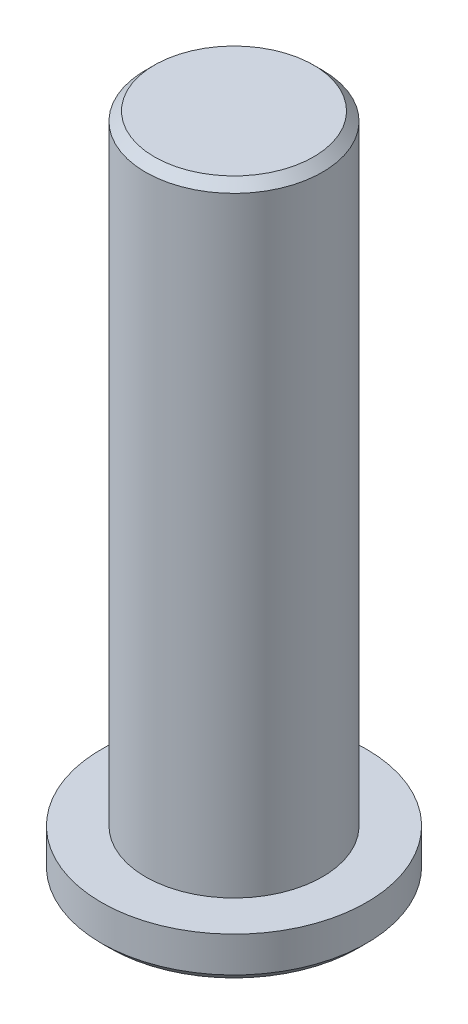
ISO-10303-21;
HEADER;
FILE_DESCRIPTION(('STEP AP214'),'2;1');
FILE_NAME('part.step','',(''),(''),'','','');
FILE_SCHEMA(('AUTOMOTIVE_DESIGN { 1 0 10303 214 1 1 1 1 }'));
ENDSEC;
DATA;
#1=APPLICATION_CONTEXT('core data for automotive mechanical design processes');
#2=APPLICATION_PROTOCOL_DEFINITION('international standard','automotive_design',2000,#1);
#3=PRODUCT_CONTEXT('',#1,'mechanical');
#4=PRODUCT('Part','Part','',(#3));
#5=PRODUCT_RELATED_PRODUCT_CATEGORY('part','',(#4));
#6=PRODUCT_DEFINITION_FORMATION('','',#4);
#7=PRODUCT_DEFINITION_CONTEXT('part definition',#1,'design');
#8=PRODUCT_DEFINITION('design','',#6,#7);
#9=PRODUCT_DEFINITION_SHAPE('','',#8);
#10=(LENGTH_UNIT() NAMED_UNIT(*) SI_UNIT(.MILLI.,.METRE.));
#11=(NAMED_UNIT(*) PLANE_ANGLE_UNIT() SI_UNIT($,.RADIAN.));
#12=(NAMED_UNIT(*) SI_UNIT($,.STERADIAN.) SOLID_ANGLE_UNIT());
#13=UNCERTAINTY_MEASURE_WITH_UNIT(LENGTH_MEASURE(1.E-05),#10,'distance_accuracy_value','');
#14=(GEOMETRIC_REPRESENTATION_CONTEXT(3) GLOBAL_UNCERTAINTY_ASSIGNED_CONTEXT((#13)) GLOBAL_UNIT_ASSIGNED_CONTEXT((#10,
#11,#12)) REPRESENTATION_CONTEXT('',''));
#15=CARTESIAN_POINT('',(0.,0.,0.));
#16=DIRECTION('',(0.,0.,1.));
#17=DIRECTION('',(1.,0.,0.));
#18=AXIS2_PLACEMENT_3D('',#15,#16,#17);
#19=CARTESIAN_POINT('',(0.,5.,0.));
#20=DIRECTION('',(0.,-1.,0.));
#21=DIRECTION('',(0.,0.,-1.));
#22=AXIS2_PLACEMENT_3D('',#19,#20,#21);
#23=CYLINDRICAL_SURFACE('',#22,15.);
#24=CARTESIAN_POINT('',(0.,1.00000000000002,0.));
#25=DIRECTION('',(0.,1.,0.));
#26=DIRECTION('',(0.,0.,1.));
#27=AXIS2_PLACEMENT_3D('',#24,#25,#26);
#28=CIRCLE('',#27,15.);
#29=CARTESIAN_POINT('',(0.,1.00000000000002,15.));
#30=VERTEX_POINT('',#29);
#31=EDGE_CURVE('E39',#30,#30,#28,.T.);
#32=ORIENTED_EDGE('',*,*,#31,.T.);
#33=EDGE_LOOP('',(#32));
#34=FACE_BOUND('',#33,.T.);
#35=CARTESIAN_POINT('',(0.,5.,0.));
#36=DIRECTION('',(0.,1.,0.));
#37=DIRECTION('',(0.,0.,1.));
#38=AXIS2_PLACEMENT_3D('',#35,#36,#37);
#39=CIRCLE('',#38,15.);
#40=CARTESIAN_POINT('',(0.,5.,15.));
#41=VERTEX_POINT('',#40);
#42=EDGE_CURVE('E53',#41,#41,#39,.T.);
#43=ORIENTED_EDGE('',*,*,#42,.F.);
#44=EDGE_LOOP('',(#43));
#45=FACE_BOUND('',#44,.T.);
#46=ADVANCED_FACE('F32',(#34,#45),#23,.T.);
#47=CARTESIAN_POINT('',(0.,5.,0.));
#48=DIRECTION('',(0.,1.,0.));
#49=DIRECTION('',(0.,0.,1.));
#50=AXIS2_PLACEMENT_3D('',#47,#48,#49);
#51=PLANE('',#50);
#52=CARTESIAN_POINT('',(0.,5.,0.));
#53=DIRECTION('',(0.,1.,0.));
#54=DIRECTION('',(0.,0.,1.));
#55=AXIS2_PLACEMENT_3D('',#52,#53,#54);
#56=CIRCLE('',#55,10.);
#57=CARTESIAN_POINT('',(0.,5.,10.));
#58=VERTEX_POINT('',#57);
#59=EDGE_CURVE('E52',#58,#58,#56,.T.);
#60=ORIENTED_EDGE('',*,*,#59,.F.);
#61=EDGE_LOOP('',(#60));
#62=FACE_BOUND('',#61,.T.);
#63=ORIENTED_EDGE('',*,*,#42,.T.);
#64=EDGE_LOOP('',(#63));
#65=FACE_BOUND('',#64,.T.);
#66=ADVANCED_FACE('F61',(#62,#65),#51,.T.);
#67=CARTESIAN_POINT('',(0.,0.,0.));
#68=DIRECTION('',(0.,1.,0.));
#69=DIRECTION('',(0.,0.,1.));
#70=AXIS2_PLACEMENT_3D('',#67,#68,#69);
#71=PLANE('',#70);
#72=CARTESIAN_POINT('',(0.,0.,0.));
#73=DIRECTION('',(0.,1.,0.));
#74=DIRECTION('',(0.,0.,1.));
#75=AXIS2_PLACEMENT_3D('',#72,#73,#74);
#76=CIRCLE('',#75,14.);
#77=CARTESIAN_POINT('',(0.,0.,14.));
#78=VERTEX_POINT('',#77);
#79=EDGE_CURVE('E10',#78,#78,#76,.F.);
#80=ORIENTED_EDGE('',*,*,#79,.T.);
#81=EDGE_LOOP('',(#80));
#82=FACE_BOUND('',#81,.T.);
#83=ADVANCED_FACE('F64',(#82),#71,.F.);
#84=CARTESIAN_POINT('',(0.,75.,0.));
#85=DIRECTION('',(0.,-1.,0.));
#86=DIRECTION('',(0.,0.,-1.));
#87=AXIS2_PLACEMENT_3D('',#84,#85,#86);
#88=CYLINDRICAL_SURFACE('',#87,10.);
#89=CARTESIAN_POINT('',(0.,74.,0.));
#90=DIRECTION('',(0.,1.,0.));
#91=DIRECTION('',(0.,0.,1.));
#92=AXIS2_PLACEMENT_3D('',#89,#90,#91);
#93=CIRCLE('',#92,10.);
#94=CARTESIAN_POINT('',(0.,74.,10.));
#95=VERTEX_POINT('',#94);
#96=EDGE_CURVE('E43',#95,#95,#93,.F.);
#97=ORIENTED_EDGE('',*,*,#96,.T.);
#98=EDGE_LOOP('',(#97));
#99=FACE_BOUND('',#98,.T.);
#100=ORIENTED_EDGE('',*,*,#59,.T.);
#101=EDGE_LOOP('',(#100));
#102=FACE_BOUND('',#101,.T.);
#103=ADVANCED_FACE('F59',(#99,#102),#88,.T.);
#104=CARTESIAN_POINT('',(0.,75.,0.));
#105=DIRECTION('',(0.,1.,0.));
#106=DIRECTION('',(0.,0.,1.));
#107=AXIS2_PLACEMENT_3D('',#104,#105,#106);
#108=PLANE('',#107);
#109=CARTESIAN_POINT('',(0.,75.,0.));
#110=DIRECTION('',(0.,1.,0.));
#111=DIRECTION('',(0.,0.,1.));
#112=AXIS2_PLACEMENT_3D('',#109,#110,#111);
#113=CIRCLE('',#112,8.99999999999999);
#114=CARTESIAN_POINT('',(0.,75.,8.99999999999999));
#115=VERTEX_POINT('',#114);
#116=EDGE_CURVE('E47',#115,#115,#113,.T.);
#117=ORIENTED_EDGE('',*,*,#116,.T.);
#118=EDGE_LOOP('',(#117));
#119=FACE_BOUND('',#118,.T.);
#120=ADVANCED_FACE('F75',(#119),#108,.T.);
#121=CARTESIAN_POINT('',(0.,75.,0.));
#122=DIRECTION('',(0.,-1.,0.));
#123=DIRECTION('',(0.,0.,-1.));
#124=AXIS2_PLACEMENT_3D('',#121,#122,#123);
#125=CONICAL_SURFACE('',#124,8.99999999999999,0.785398163397454);
#126=ORIENTED_EDGE('',*,*,#96,.F.);
#127=EDGE_LOOP('',(#126));
#128=FACE_BOUND('',#127,.T.);
#129=ORIENTED_EDGE('',*,*,#116,.F.);
#130=EDGE_LOOP('',(#129));
#131=FACE_BOUND('',#130,.T.);
#132=ADVANCED_FACE('F73',(#128,#131),#125,.T.);
#133=CARTESIAN_POINT('',(0.,1.00000000000002,0.));
#134=DIRECTION('',(0.,1.,0.));
#135=DIRECTION('',(0.,0.,1.));
#136=AXIS2_PLACEMENT_3D('',#133,#134,#135);
#137=CONICAL_SURFACE('',#136,15.,0.785398163397447);
#138=ORIENTED_EDGE('',*,*,#79,.F.);
#139=EDGE_LOOP('',(#138));
#140=FACE_BOUND('',#139,.T.);
#141=ORIENTED_EDGE('',*,*,#31,.F.);
#142=EDGE_LOOP('',(#141));
#143=FACE_BOUND('',#142,.T.);
#144=ADVANCED_FACE('F34',(#140,#143),#137,.T.);
#145=CLOSED_SHELL('',(#46,#66,#83,#103,#120,#132,#144));
#146=MANIFOLD_SOLID_BREP('B2',#145);
#147=ADVANCED_BREP_SHAPE_REPRESENTATION('',(#18,#146),#14);
#148=SHAPE_DEFINITION_REPRESENTATION(#9,#147);
ENDSEC;
END-ISO-10303-21;
